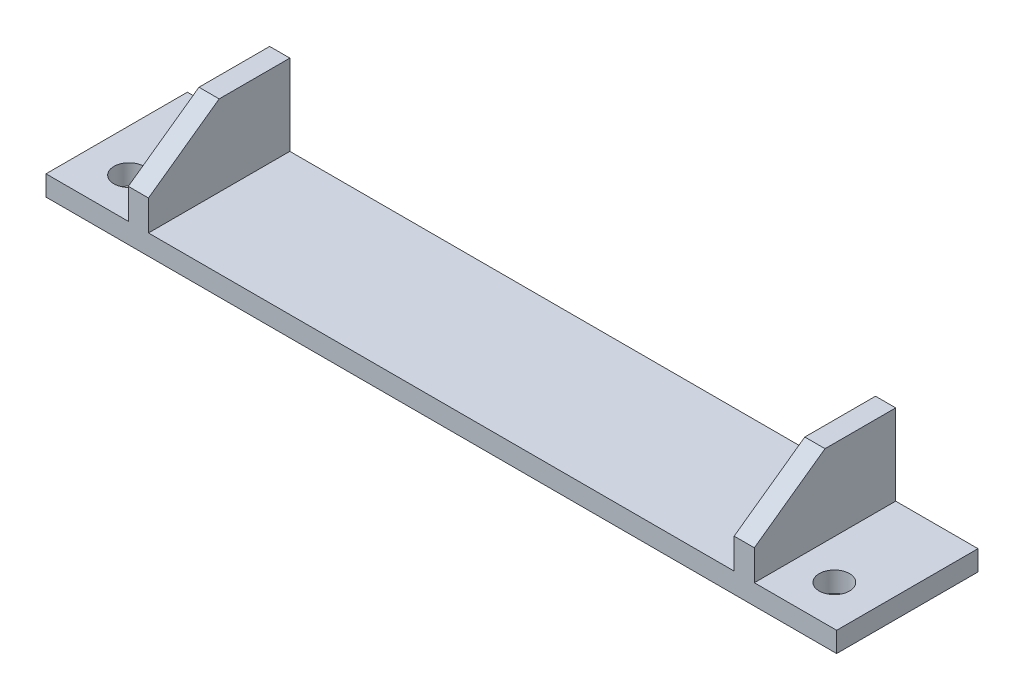
ISO-10303-21;
HEADER;
FILE_DESCRIPTION(('STEP AP214'),'2;1');
FILE_NAME('part.step','',(''),(''),'','','');
FILE_SCHEMA(('AUTOMOTIVE_DESIGN { 1 0 10303 214 1 1 1 1 }'));
ENDSEC;
DATA;
#1=APPLICATION_CONTEXT('core data for automotive mechanical design processes');
#2=APPLICATION_PROTOCOL_DEFINITION('international standard','automotive_design',2000,#1);
#3=PRODUCT_CONTEXT('',#1,'mechanical');
#4=PRODUCT('Part','Part','',(#3));
#5=PRODUCT_RELATED_PRODUCT_CATEGORY('part','',(#4));
#6=PRODUCT_DEFINITION_FORMATION('','',#4);
#7=PRODUCT_DEFINITION_CONTEXT('part definition',#1,'design');
#8=PRODUCT_DEFINITION('design','',#6,#7);
#9=PRODUCT_DEFINITION_SHAPE('','',#8);
#10=(LENGTH_UNIT() NAMED_UNIT(*) SI_UNIT(.MILLI.,.METRE.));
#11=(NAMED_UNIT(*) PLANE_ANGLE_UNIT() SI_UNIT($,.RADIAN.));
#12=(NAMED_UNIT(*) SI_UNIT($,.STERADIAN.) SOLID_ANGLE_UNIT());
#13=UNCERTAINTY_MEASURE_WITH_UNIT(LENGTH_MEASURE(1.E-05),#10,'distance_accuracy_value','');
#14=(GEOMETRIC_REPRESENTATION_CONTEXT(3) GLOBAL_UNCERTAINTY_ASSIGNED_CONTEXT((#13)) GLOBAL_UNIT_ASSIGNED_CONTEXT((#10,
#11,#12)) REPRESENTATION_CONTEXT('',''));
#15=CARTESIAN_POINT('',(0.,0.,0.));
#16=DIRECTION('',(0.,0.,1.));
#17=DIRECTION('',(1.,0.,0.));
#18=AXIS2_PLACEMENT_3D('',#15,#16,#17);
#19=CARTESIAN_POINT('',(0.,2.,0.));
#20=DIRECTION('',(0.,-1.,0.));
#21=DIRECTION('',(0.,0.,-1.));
#22=AXIS2_PLACEMENT_3D('',#19,#20,#21);
#23=PLANE('',#22);
#24=CARTESIAN_POINT('',(44.6246451696033,2.,-0.832823468273441));
#25=DIRECTION('',(0.,-1.,0.));
#26=DIRECTION('',(0.,0.,-1.));
#27=AXIS2_PLACEMENT_3D('',#24,#25,#26);
#28=CIRCLE('',#27,1.5);
#29=CARTESIAN_POINT('',(44.6246451696033,2.,-2.33282346827344));
#30=VERTEX_POINT('',#29);
#31=EDGE_CURVE('E292',#30,#30,#28,.T.);
#32=ORIENTED_EDGE('',*,*,#31,.T.);
#33=EDGE_LOOP('',(#32));
#34=FACE_BOUND('',#33,.T.);
#35=DIRECTION('',(0.,0.,-1.));
#36=VECTOR('',#35,1.);
#37=CARTESIAN_POINT('',(40.6996451696033,2.,-10.8328234682735));
#38=LINE('',#37,#36);
#39=CARTESIAN_POINT('',(40.6996451696033,2.,3.16717653172655));
#40=VERTEX_POINT('',#39);
#41=CARTESIAN_POINT('',(40.6996451696033,2.,-10.8328234682735));
#42=VERTEX_POINT('',#41);
#43=EDGE_CURVE('E223',#40,#42,#38,.T.);
#44=ORIENTED_EDGE('',*,*,#43,.F.);
#45=DIRECTION('',(1.,0.,0.));
#46=VECTOR('',#45,1.);
#47=CARTESIAN_POINT('',(-29.4503548303967,2.,3.16717653172655));
#48=LINE('',#47,#46);
#49=CARTESIAN_POINT('',(48.8496451696033,2.,3.16717653172654));
#50=VERTEX_POINT('',#49);
#51=EDGE_CURVE('E306',#40,#50,#48,.T.);
#52=ORIENTED_EDGE('',*,*,#51,.T.);
#53=DIRECTION('',(0.,0.,1.));
#54=VECTOR('',#53,1.);
#55=CARTESIAN_POINT('',(48.8496451696033,2.,-10.8328234682735));
#56=LINE('',#55,#54);
#57=CARTESIAN_POINT('',(48.8496451696033,2.,-10.8328234682735));
#58=VERTEX_POINT('',#57);
#59=EDGE_CURVE('E304',#58,#50,#56,.T.);
#60=ORIENTED_EDGE('',*,*,#59,.F.);
#61=DIRECTION('',(1.,0.,0.));
#62=VECTOR('',#61,1.);
#63=CARTESIAN_POINT('',(-29.4503548303967,2.,-10.8328234682734));
#64=LINE('',#63,#62);
#65=EDGE_CURVE('E309',#42,#58,#64,.T.);
#66=ORIENTED_EDGE('',*,*,#65,.F.);
#67=EDGE_LOOP('',(#44,#52,#60,#66));
#68=FACE_BOUND('',#67,.T.);
#69=ADVANCED_FACE('F42',(#34,#68),#23,.F.);
#70=DIRECTION('',(0.,0.,1.));
#71=VECTOR('',#70,1.);
#72=CARTESIAN_POINT('',(38.6996451696033,2.,-10.8328234682735));
#73=LINE('',#72,#71);
#74=CARTESIAN_POINT('',(38.6996451696033,2.,-10.8328234682735));
#75=VERTEX_POINT('',#74);
#76=CARTESIAN_POINT('',(38.6996451696033,2.,3.16717653172655));
#77=VERTEX_POINT('',#76);
#78=EDGE_CURVE('E368',#75,#77,#73,.T.);
#79=ORIENTED_EDGE('',*,*,#78,.F.);
#80=CARTESIAN_POINT('',(-19.3003548303967,2.,-10.8328234682734));
#81=VERTEX_POINT('',#80);
#82=EDGE_CURVE('E314',#81,#75,#64,.T.);
#83=ORIENTED_EDGE('',*,*,#82,.F.);
#84=DIRECTION('',(0.,0.,-1.));
#85=VECTOR('',#84,1.);
#86=CARTESIAN_POINT('',(-19.3003548303967,2.,-10.8328234682734));
#87=LINE('',#86,#85);
#88=CARTESIAN_POINT('',(-19.3003548303967,2.,3.16717653172655));
#89=VERTEX_POINT('',#88);
#90=EDGE_CURVE('E211',#89,#81,#87,.T.);
#91=ORIENTED_EDGE('',*,*,#90,.F.);
#92=EDGE_CURVE('E305',#89,#77,#48,.T.);
#93=ORIENTED_EDGE('',*,*,#92,.T.);
#94=EDGE_LOOP('',(#79,#83,#91,#93));
#95=FACE_BOUND('',#94,.T.);
#96=ADVANCED_FACE('F366',(#95),#23,.F.);
#97=CARTESIAN_POINT('',(-25.2253548303967,2.,-0.832823468273441));
#98=DIRECTION('',(0.,-1.,0.));
#99=DIRECTION('',(0.,0.,-1.));
#100=AXIS2_PLACEMENT_3D('',#97,#98,#99);
#101=CIRCLE('',#100,1.5);
#102=CARTESIAN_POINT('',(-25.2253548303967,2.,-2.33282346827344));
#103=VERTEX_POINT('',#102);
#104=EDGE_CURVE('E297',#103,#103,#101,.T.);
#105=ORIENTED_EDGE('',*,*,#104,.T.);
#106=EDGE_LOOP('',(#105));
#107=FACE_BOUND('',#106,.T.);
#108=DIRECTION('',(0.,0.,1.));
#109=VECTOR('',#108,1.);
#110=CARTESIAN_POINT('',(-21.3003548303967,2.,-10.8328234682734));
#111=LINE('',#110,#109);
#112=CARTESIAN_POINT('',(-21.3003548303967,2.,-10.8328234682734));
#113=VERTEX_POINT('',#112);
#114=CARTESIAN_POINT('',(-21.3003548303967,2.,3.16717653172655));
#115=VERTEX_POINT('',#114);
#116=EDGE_CURVE('E215',#113,#115,#111,.T.);
#117=ORIENTED_EDGE('',*,*,#116,.F.);
#118=CARTESIAN_POINT('',(-29.4503548303967,2.,-10.8328234682734));
#119=VERTEX_POINT('',#118);
#120=EDGE_CURVE('E310',#119,#113,#64,.T.);
#121=ORIENTED_EDGE('',*,*,#120,.F.);
#122=DIRECTION('',(0.,0.,1.));
#123=VECTOR('',#122,1.);
#124=CARTESIAN_POINT('',(-29.4503548303967,2.,-10.8328234682734));
#125=LINE('',#124,#123);
#126=CARTESIAN_POINT('',(-29.4503548303967,2.,3.16717653172655));
#127=VERTEX_POINT('',#126);
#128=EDGE_CURVE('E313',#119,#127,#125,.T.);
#129=ORIENTED_EDGE('',*,*,#128,.T.);
#130=EDGE_CURVE('E301',#127,#115,#48,.T.);
#131=ORIENTED_EDGE('',*,*,#130,.T.);
#132=EDGE_LOOP('',(#117,#121,#129,#131));
#133=FACE_BOUND('',#132,.T.);
#134=ADVANCED_FACE('F418',(#107,#133),#23,.F.);
#135=CARTESIAN_POINT('',(0.,0.,0.));
#136=DIRECTION('',(0.,-1.,0.));
#137=DIRECTION('',(0.,0.,-1.));
#138=AXIS2_PLACEMENT_3D('',#135,#136,#137);
#139=PLANE('',#138);
#140=CARTESIAN_POINT('',(-25.2253548303967,0.,-0.832823468273441));
#141=DIRECTION('',(0.,1.,0.));
#142=DIRECTION('',(0.,0.,1.));
#143=AXIS2_PLACEMENT_3D('',#140,#141,#142);
#144=CIRCLE('',#143,1.5);
#145=CARTESIAN_POINT('',(-25.2253548303967,0.,0.66717653172656));
#146=VERTEX_POINT('',#145);
#147=EDGE_CURVE('E289',#146,#146,#144,.T.);
#148=ORIENTED_EDGE('',*,*,#147,.T.);
#149=EDGE_LOOP('',(#148));
#150=FACE_BOUND('',#149,.T.);
#151=CARTESIAN_POINT('',(44.6246451696033,0.,-0.832823468273441));
#152=DIRECTION('',(0.,1.,0.));
#153=DIRECTION('',(0.,0.,1.));
#154=AXIS2_PLACEMENT_3D('',#151,#152,#153);
#155=CIRCLE('',#154,1.5);
#156=CARTESIAN_POINT('',(44.6246451696033,0.,0.667176531726563));
#157=VERTEX_POINT('',#156);
#158=EDGE_CURVE('E288',#157,#157,#155,.T.);
#159=ORIENTED_EDGE('',*,*,#158,.T.);
#160=EDGE_LOOP('',(#159));
#161=FACE_BOUND('',#160,.T.);
#162=DIRECTION('',(1.,0.,0.));
#163=VECTOR('',#162,1.);
#164=CARTESIAN_POINT('',(-29.4503548303967,0.,-10.8328234682734));
#165=LINE('',#164,#163);
#166=CARTESIAN_POINT('',(-9.50035483039672,0.,-10.8328234682734));
#167=VERTEX_POINT('',#166);
#168=CARTESIAN_POINT('',(28.8996451696033,0.,-10.8328234682734));
#169=VERTEX_POINT('',#168);
#170=EDGE_CURVE('E326',#167,#169,#165,.T.);
#171=ORIENTED_EDGE('',*,*,#170,.T.);
#172=DIRECTION('',(0.,0.,-1.));
#173=VECTOR('',#172,1.);
#174=CARTESIAN_POINT('',(28.8996451696033,0.,-10.8328234682734));
#175=LINE('',#174,#173);
#176=CARTESIAN_POINT('',(28.8996451696033,0.,-7.83282346827344));
#177=VERTEX_POINT('',#176);
#178=EDGE_CURVE('E248',#177,#169,#175,.T.);
#179=ORIENTED_EDGE('',*,*,#178,.F.);
#180=DIRECTION('',(-1.,0.,0.));
#181=VECTOR('',#180,1.);
#182=CARTESIAN_POINT('',(28.8996451696033,0.,-7.83282346827344));
#183=LINE('',#182,#181);
#184=CARTESIAN_POINT('',(31.8996451696033,0.,-7.83282346827344));
#185=VERTEX_POINT('',#184);
#186=EDGE_CURVE('E242',#185,#177,#183,.T.);
#187=ORIENTED_EDGE('',*,*,#186,.F.);
#188=DIRECTION('',(0.,0.,1.));
#189=VECTOR('',#188,1.);
#190=CARTESIAN_POINT('',(31.8996451696033,0.,-10.8328234682734));
#191=LINE('',#190,#189);
#192=CARTESIAN_POINT('',(31.8996451696033,0.,-10.8328234682734));
#193=VERTEX_POINT('',#192);
#194=EDGE_CURVE('E244',#193,#185,#191,.T.);
#195=ORIENTED_EDGE('',*,*,#194,.F.);
#196=CARTESIAN_POINT('',(48.8496451696033,0.,-10.8328234682735));
#197=VERTEX_POINT('',#196);
#198=EDGE_CURVE('E322',#193,#197,#165,.T.);
#199=ORIENTED_EDGE('',*,*,#198,.T.);
#200=DIRECTION('',(0.,0.,1.));
#201=VECTOR('',#200,1.);
#202=CARTESIAN_POINT('',(48.8496451696033,0.,-10.8328234682735));
#203=LINE('',#202,#201);
#204=CARTESIAN_POINT('',(48.8496451696033,0.,3.16717653172654));
#205=VERTEX_POINT('',#204);
#206=EDGE_CURVE('E319',#197,#205,#203,.T.);
#207=ORIENTED_EDGE('',*,*,#206,.T.);
#208=DIRECTION('',(1.,0.,0.));
#209=VECTOR('',#208,1.);
#210=CARTESIAN_POINT('',(-29.4503548303967,0.,3.16717653172655));
#211=LINE('',#210,#209);
#212=CARTESIAN_POINT('',(-29.4503548303967,0.,3.16717653172655));
#213=VERTEX_POINT('',#212);
#214=EDGE_CURVE('E300',#213,#205,#211,.T.);
#215=ORIENTED_EDGE('',*,*,#214,.F.);
#216=DIRECTION('',(0.,0.,1.));
#217=VECTOR('',#216,1.);
#218=CARTESIAN_POINT('',(-29.4503548303967,0.,-10.8328234682734));
#219=LINE('',#218,#217);
#220=CARTESIAN_POINT('',(-29.4503548303967,0.,-10.8328234682734));
#221=VERTEX_POINT('',#220);
#222=EDGE_CURVE('E325',#221,#213,#219,.T.);
#223=ORIENTED_EDGE('',*,*,#222,.F.);
#224=CARTESIAN_POINT('',(-12.5003548303967,0.,-10.8328234682734));
#225=VERTEX_POINT('',#224);
#226=EDGE_CURVE('E323',#221,#225,#165,.T.);
#227=ORIENTED_EDGE('',*,*,#226,.T.);
#228=DIRECTION('',(0.,0.,-1.));
#229=VECTOR('',#228,1.);
#230=CARTESIAN_POINT('',(-12.5003548303967,0.,-10.8328234682734));
#231=LINE('',#230,#229);
#232=CARTESIAN_POINT('',(-12.5003548303967,0.,-7.83282346827344));
#233=VERTEX_POINT('',#232);
#234=EDGE_CURVE('E263',#233,#225,#231,.T.);
#235=ORIENTED_EDGE('',*,*,#234,.F.);
#236=DIRECTION('',(-1.,0.,0.));
#237=VECTOR('',#236,1.);
#238=CARTESIAN_POINT('',(-9.50035483039672,0.,-7.83282346827344));
#239=LINE('',#238,#237);
#240=CARTESIAN_POINT('',(-9.50035483039672,0.,-7.83282346827344));
#241=VERTEX_POINT('',#240);
#242=EDGE_CURVE('E272',#241,#233,#239,.T.);
#243=ORIENTED_EDGE('',*,*,#242,.F.);
#244=DIRECTION('',(0.,0.,1.));
#245=VECTOR('',#244,1.);
#246=CARTESIAN_POINT('',(-9.50035483039672,0.,-10.8328234682734));
#247=LINE('',#246,#245);
#248=EDGE_CURVE('E251',#167,#241,#247,.T.);
#249=ORIENTED_EDGE('',*,*,#248,.F.);
#250=EDGE_LOOP('',(#171,#179,#187,#195,#199,#207,#215,#223,#227,#235,#243,#249));
#251=FACE_BOUND('',#250,.T.);
#252=ADVANCED_FACE('F349',(#150,#161,#251),#139,.T.);
#253=CARTESIAN_POINT('',(-29.4503548303967,2.,3.16717653172655));
#254=DIRECTION('',(0.,0.,-1.));
#255=DIRECTION('',(-1.,0.,0.));
#256=AXIS2_PLACEMENT_3D('',#253,#254,#255);
#257=PLANE('',#256);
#258=DIRECTION('',(0.,-1.,0.));
#259=VECTOR('',#258,1.);
#260=CARTESIAN_POINT('',(40.6996451696033,10.,3.16717653172655));
#261=LINE('',#260,#259);
#262=CARTESIAN_POINT('',(40.6996451696033,5.,3.16717653172655));
#263=VERTEX_POINT('',#262);
#264=EDGE_CURVE('E401',#263,#40,#261,.T.);
#265=ORIENTED_EDGE('',*,*,#264,.F.);
#266=DIRECTION('',(-1.,0.,0.));
#267=VECTOR('',#266,1.);
#268=CARTESIAN_POINT('',(48.8496451696033,5.,3.16717653172655));
#269=LINE('',#268,#267);
#270=CARTESIAN_POINT('',(38.6996451696033,5.,3.16717653172655));
#271=VERTEX_POINT('',#270);
#272=EDGE_CURVE('E374',#263,#271,#269,.T.);
#273=ORIENTED_EDGE('',*,*,#272,.T.);
#274=DIRECTION('',(0.,-1.,0.));
#275=VECTOR('',#274,1.);
#276=CARTESIAN_POINT('',(38.6996451696033,10.,3.16717653172655));
#277=LINE('',#276,#275);
#278=EDGE_CURVE('E373',#271,#77,#277,.T.);
#279=ORIENTED_EDGE('',*,*,#278,.T.);
#280=ORIENTED_EDGE('',*,*,#92,.F.);
#281=DIRECTION('',(0.,-1.,0.));
#282=VECTOR('',#281,1.);
#283=CARTESIAN_POINT('',(-19.3003548303967,10.,3.16717653172655));
#284=LINE('',#283,#282);
#285=CARTESIAN_POINT('',(-19.3003548303967,5.,3.16717653172655));
#286=VERTEX_POINT('',#285);
#287=EDGE_CURVE('E229',#286,#89,#284,.T.);
#288=ORIENTED_EDGE('',*,*,#287,.F.);
#289=CARTESIAN_POINT('',(-21.3003548303967,5.,3.16717653172655));
#290=VERTEX_POINT('',#289);
#291=EDGE_CURVE('E195',#286,#290,#269,.T.);
#292=ORIENTED_EDGE('',*,*,#291,.T.);
#293=DIRECTION('',(0.,-1.,0.));
#294=VECTOR('',#293,1.);
#295=CARTESIAN_POINT('',(-21.3003548303967,10.,3.16717653172655));
#296=LINE('',#295,#294);
#297=EDGE_CURVE('E204',#290,#115,#296,.T.);
#298=ORIENTED_EDGE('',*,*,#297,.T.);
#299=ORIENTED_EDGE('',*,*,#130,.F.);
#300=DIRECTION('',(0.,-1.,0.));
#301=VECTOR('',#300,1.);
#302=CARTESIAN_POINT('',(-29.4503548303967,2.,3.16717653172655));
#303=LINE('',#302,#301);
#304=EDGE_CURVE('E316',#127,#213,#303,.T.);
#305=ORIENTED_EDGE('',*,*,#304,.T.);
#306=ORIENTED_EDGE('',*,*,#214,.T.);
#307=DIRECTION('',(0.,-1.,0.));
#308=VECTOR('',#307,1.);
#309=CARTESIAN_POINT('',(48.8496451696033,2.,3.16717653172654));
#310=LINE('',#309,#308);
#311=EDGE_CURVE('E50',#50,#205,#310,.T.);
#312=ORIENTED_EDGE('',*,*,#311,.F.);
#313=ORIENTED_EDGE('',*,*,#51,.F.);
#314=EDGE_LOOP('',(#265,#273,#279,#280,#288,#292,#298,#299,#305,#306,#312,#313));
#315=FACE_BOUND('',#314,.T.);
#316=ADVANCED_FACE('F44',(#315),#257,.F.);
#317=CARTESIAN_POINT('',(48.8496451696033,2.,-10.8328234682735));
#318=DIRECTION('',(1.,0.,0.));
#319=DIRECTION('',(0.,0.,-1.));
#320=AXIS2_PLACEMENT_3D('',#317,#318,#319);
#321=PLANE('',#320);
#322=ORIENTED_EDGE('',*,*,#206,.F.);
#323=DIRECTION('',(0.,-1.,0.));
#324=VECTOR('',#323,1.);
#325=CARTESIAN_POINT('',(48.8496451696033,2.,-10.8328234682735));
#326=LINE('',#325,#324);
#327=EDGE_CURVE('E332',#58,#197,#326,.T.);
#328=ORIENTED_EDGE('',*,*,#327,.F.);
#329=ORIENTED_EDGE('',*,*,#59,.T.);
#330=ORIENTED_EDGE('',*,*,#311,.T.);
#331=EDGE_LOOP('',(#322,#328,#329,#330));
#332=FACE_BOUND('',#331,.T.);
#333=ADVANCED_FACE('F337',(#332),#321,.T.);
#334=CARTESIAN_POINT('',(-29.4503548303967,2.,-10.8328234682734));
#335=DIRECTION('',(0.,0.,-1.));
#336=DIRECTION('',(-1.,0.,0.));
#337=AXIS2_PLACEMENT_3D('',#334,#335,#336);
#338=PLANE('',#337);
#339=ORIENTED_EDGE('',*,*,#226,.F.);
#340=DIRECTION('',(0.,-1.,0.));
#341=VECTOR('',#340,1.);
#342=CARTESIAN_POINT('',(-29.4503548303967,2.,-10.8328234682734));
#343=LINE('',#342,#341);
#344=EDGE_CURVE('E330',#119,#221,#343,.T.);
#345=ORIENTED_EDGE('',*,*,#344,.F.);
#346=ORIENTED_EDGE('',*,*,#120,.T.);
#347=DIRECTION('',(0.,-1.,0.));
#348=VECTOR('',#347,1.);
#349=CARTESIAN_POINT('',(-21.3003548303967,10.,-10.8328234682734));
#350=LINE('',#349,#348);
#351=CARTESIAN_POINT('',(-21.3003548303967,10.,-10.8328234682734));
#352=VERTEX_POINT('',#351);
#353=EDGE_CURVE('E222',#352,#113,#350,.T.);
#354=ORIENTED_EDGE('',*,*,#353,.F.);
#355=DIRECTION('',(-1.,0.,0.));
#356=VECTOR('',#355,1.);
#357=CARTESIAN_POINT('',(-19.3003548303967,10.,-10.8328234682734));
#358=LINE('',#357,#356);
#359=CARTESIAN_POINT('',(-19.3003548303967,10.,-10.8328234682734));
#360=VERTEX_POINT('',#359);
#361=EDGE_CURVE('E208',#360,#352,#358,.T.);
#362=ORIENTED_EDGE('',*,*,#361,.F.);
#363=DIRECTION('',(0.,-1.,0.));
#364=VECTOR('',#363,1.);
#365=CARTESIAN_POINT('',(-19.3003548303967,10.,-10.8328234682734));
#366=LINE('',#365,#364);
#367=EDGE_CURVE('E226',#360,#81,#366,.T.);
#368=ORIENTED_EDGE('',*,*,#367,.T.);
#369=ORIENTED_EDGE('',*,*,#82,.T.);
#370=DIRECTION('',(0.,-1.,0.));
#371=VECTOR('',#370,1.);
#372=CARTESIAN_POINT('',(38.6996451696033,10.,-10.8328234682735));
#373=LINE('',#372,#371);
#374=CARTESIAN_POINT('',(38.6996451696033,10.,-10.8328234682735));
#375=VERTEX_POINT('',#374);
#376=EDGE_CURVE('E378',#375,#75,#373,.T.);
#377=ORIENTED_EDGE('',*,*,#376,.F.);
#378=DIRECTION('',(-1.,0.,0.));
#379=VECTOR('',#378,1.);
#380=CARTESIAN_POINT('',(38.6996451696033,10.,-10.8328234682735));
#381=LINE('',#380,#379);
#382=CARTESIAN_POINT('',(40.6996451696033,10.,-10.8328234682735));
#383=VERTEX_POINT('',#382);
#384=EDGE_CURVE('E385',#383,#375,#381,.T.);
#385=ORIENTED_EDGE('',*,*,#384,.F.);
#386=DIRECTION('',(0.,-1.,0.));
#387=VECTOR('',#386,1.);
#388=CARTESIAN_POINT('',(40.6996451696033,10.,-10.8328234682735));
#389=LINE('',#388,#387);
#390=EDGE_CURVE('E394',#383,#42,#389,.T.);
#391=ORIENTED_EDGE('',*,*,#390,.T.);
#392=ORIENTED_EDGE('',*,*,#65,.T.);
#393=ORIENTED_EDGE('',*,*,#327,.T.);
#394=ORIENTED_EDGE('',*,*,#198,.F.);
#395=DIRECTION('',(0.,1.,0.));
#396=VECTOR('',#395,1.);
#397=CARTESIAN_POINT('',(31.8996451696033,-2.,-10.8328234682734));
#398=LINE('',#397,#396);
#399=CARTESIAN_POINT('',(31.8996451696033,-2.,-10.8328234682734));
#400=VERTEX_POINT('',#399);
#401=EDGE_CURVE('E234',#400,#193,#398,.T.);
#402=ORIENTED_EDGE('',*,*,#401,.F.);
#403=DIRECTION('',(1.,0.,0.));
#404=VECTOR('',#403,1.);
#405=CARTESIAN_POINT('',(28.8996451696033,-2.,-10.8328234682734));
#406=LINE('',#405,#404);
#407=CARTESIAN_POINT('',(28.8996451696033,-2.,-10.8328234682734));
#408=VERTEX_POINT('',#407);
#409=EDGE_CURVE('E255',#408,#400,#406,.T.);
#410=ORIENTED_EDGE('',*,*,#409,.F.);
#411=DIRECTION('',(0.,1.,0.));
#412=VECTOR('',#411,1.);
#413=CARTESIAN_POINT('',(28.8996451696033,-2.,-10.8328234682734));
#414=LINE('',#413,#412);
#415=EDGE_CURVE('E232',#408,#169,#414,.T.);
#416=ORIENTED_EDGE('',*,*,#415,.T.);
#417=ORIENTED_EDGE('',*,*,#170,.F.);
#418=DIRECTION('',(0.,1.,0.));
#419=VECTOR('',#418,1.);
#420=CARTESIAN_POINT('',(-9.50035483039672,-2.,-10.8328234682734));
#421=LINE('',#420,#419);
#422=CARTESIAN_POINT('',(-9.50035483039672,-2.,-10.8328234682734));
#423=VERTEX_POINT('',#422);
#424=EDGE_CURVE('E269',#423,#167,#421,.T.);
#425=ORIENTED_EDGE('',*,*,#424,.F.);
#426=DIRECTION('',(1.,0.,0.));
#427=VECTOR('',#426,1.);
#428=CARTESIAN_POINT('',(-9.50035483039672,-2.,-10.8328234682734));
#429=LINE('',#428,#427);
#430=CARTESIAN_POINT('',(-12.5003548303967,-2.,-10.8328234682734));
#431=VERTEX_POINT('',#430);
#432=EDGE_CURVE('E267',#431,#423,#429,.T.);
#433=ORIENTED_EDGE('',*,*,#432,.F.);
#434=DIRECTION('',(0.,1.,0.));
#435=VECTOR('',#434,1.);
#436=CARTESIAN_POINT('',(-12.5003548303967,-2.,-10.8328234682734));
#437=LINE('',#436,#435);
#438=EDGE_CURVE('E279',#431,#225,#437,.T.);
#439=ORIENTED_EDGE('',*,*,#438,.T.);
#440=EDGE_LOOP('',(#339,#345,#346,#354,#362,#368,#369,#377,#385,#391,#392,#393,#394,#402,#410,
#416,#417,#425,#433,#439));
#441=FACE_BOUND('',#440,.T.);
#442=ADVANCED_FACE('F356',(#441),#338,.T.);
#443=CARTESIAN_POINT('',(-29.4503548303967,2.,-10.8328234682734));
#444=DIRECTION('',(1.,0.,0.));
#445=DIRECTION('',(0.,0.,-1.));
#446=AXIS2_PLACEMENT_3D('',#443,#444,#445);
#447=PLANE('',#446);
#448=ORIENTED_EDGE('',*,*,#222,.T.);
#449=ORIENTED_EDGE('',*,*,#304,.F.);
#450=ORIENTED_EDGE('',*,*,#128,.F.);
#451=ORIENTED_EDGE('',*,*,#344,.T.);
#452=EDGE_LOOP('',(#448,#449,#450,#451));
#453=FACE_BOUND('',#452,.T.);
#454=ADVANCED_FACE('F435',(#453),#447,.F.);
#455=CARTESIAN_POINT('',(44.6246451696033,0.,-0.832823468273441));
#456=DIRECTION('',(0.,1.,0.));
#457=DIRECTION('',(0.,0.,1.));
#458=AXIS2_PLACEMENT_3D('',#455,#456,#457);
#459=CYLINDRICAL_SURFACE('',#458,1.5);
#460=ORIENTED_EDGE('',*,*,#158,.F.);
#461=EDGE_LOOP('',(#460));
#462=FACE_BOUND('',#461,.T.);
#463=ORIENTED_EDGE('',*,*,#31,.F.);
#464=EDGE_LOOP('',(#463));
#465=FACE_BOUND('',#464,.T.);
#466=ADVANCED_FACE('F480',(#462,#465),#459,.F.);
#467=CARTESIAN_POINT('',(-25.2253548303967,0.,-0.832823468273441));
#468=DIRECTION('',(0.,1.,0.));
#469=DIRECTION('',(0.,0.,1.));
#470=AXIS2_PLACEMENT_3D('',#467,#468,#469);
#471=CYLINDRICAL_SURFACE('',#470,1.5);
#472=ORIENTED_EDGE('',*,*,#147,.F.);
#473=EDGE_LOOP('',(#472));
#474=FACE_BOUND('',#473,.T.);
#475=ORIENTED_EDGE('',*,*,#104,.F.);
#476=EDGE_LOOP('',(#475));
#477=FACE_BOUND('',#476,.T.);
#478=ADVANCED_FACE('F477',(#474,#477),#471,.F.);
#479=CARTESIAN_POINT('',(-9.50035483039672,-2.,-10.8328234682734));
#480=DIRECTION('',(-1.,0.,0.));
#481=DIRECTION('',(0.,0.,1.));
#482=AXIS2_PLACEMENT_3D('',#479,#480,#481);
#483=PLANE('',#482);
#484=ORIENTED_EDGE('',*,*,#248,.T.);
#485=DIRECTION('',(0.,1.,0.));
#486=VECTOR('',#485,1.);
#487=CARTESIAN_POINT('',(-9.50035483039672,-2.,-7.83282346827344));
#488=LINE('',#487,#486);
#489=CARTESIAN_POINT('',(-9.50035483039672,-2.,-7.83282346827344));
#490=VERTEX_POINT('',#489);
#491=EDGE_CURVE('E285',#490,#241,#488,.T.);
#492=ORIENTED_EDGE('',*,*,#491,.F.);
#493=DIRECTION('',(0.,0.,1.));
#494=VECTOR('',#493,1.);
#495=CARTESIAN_POINT('',(-9.50035483039672,-2.,-10.8328234682734));
#496=LINE('',#495,#494);
#497=EDGE_CURVE('E259',#423,#490,#496,.T.);
#498=ORIENTED_EDGE('',*,*,#497,.F.);
#499=ORIENTED_EDGE('',*,*,#424,.T.);
#500=EDGE_LOOP('',(#484,#492,#498,#499));
#501=FACE_BOUND('',#500,.T.);
#502=ADVANCED_FACE('F473',(#501),#483,.F.);
#503=CARTESIAN_POINT('',(-9.50035483039672,-2.,-7.83282346827344));
#504=DIRECTION('',(0.,0.,-1.));
#505=DIRECTION('',(-1.,0.,0.));
#506=AXIS2_PLACEMENT_3D('',#503,#504,#505);
#507=PLANE('',#506);
#508=ORIENTED_EDGE('',*,*,#242,.T.);
#509=DIRECTION('',(0.,1.,0.));
#510=VECTOR('',#509,1.);
#511=CARTESIAN_POINT('',(-12.5003548303967,-2.,-7.83282346827344));
#512=LINE('',#511,#510);
#513=CARTESIAN_POINT('',(-12.5003548303967,-2.,-7.83282346827344));
#514=VERTEX_POINT('',#513);
#515=EDGE_CURVE('E282',#514,#233,#512,.T.);
#516=ORIENTED_EDGE('',*,*,#515,.F.);
#517=DIRECTION('',(-1.,0.,0.));
#518=VECTOR('',#517,1.);
#519=CARTESIAN_POINT('',(-9.50035483039672,-2.,-7.83282346827344));
#520=LINE('',#519,#518);
#521=EDGE_CURVE('E262',#490,#514,#520,.T.);
#522=ORIENTED_EDGE('',*,*,#521,.F.);
#523=ORIENTED_EDGE('',*,*,#491,.T.);
#524=EDGE_LOOP('',(#508,#516,#522,#523));
#525=FACE_BOUND('',#524,.T.);
#526=ADVANCED_FACE('F469',(#525),#507,.F.);
#527=CARTESIAN_POINT('',(-12.5003548303967,-2.,-10.8328234682734));
#528=DIRECTION('',(1.,0.,0.));
#529=DIRECTION('',(0.,0.,-1.));
#530=AXIS2_PLACEMENT_3D('',#527,#528,#529);
#531=PLANE('',#530);
#532=ORIENTED_EDGE('',*,*,#234,.T.);
#533=ORIENTED_EDGE('',*,*,#438,.F.);
#534=DIRECTION('',(0.,0.,-1.));
#535=VECTOR('',#534,1.);
#536=CARTESIAN_POINT('',(-12.5003548303967,-2.,-10.8328234682734));
#537=LINE('',#536,#535);
#538=EDGE_CURVE('E265',#514,#431,#537,.T.);
#539=ORIENTED_EDGE('',*,*,#538,.F.);
#540=ORIENTED_EDGE('',*,*,#515,.T.);
#541=EDGE_LOOP('',(#532,#533,#539,#540));
#542=FACE_BOUND('',#541,.T.);
#543=ADVANCED_FACE('F465',(#542),#531,.F.);
#544=CARTESIAN_POINT('',(0.,-2.,0.));
#545=DIRECTION('',(0.,-1.,0.));
#546=DIRECTION('',(0.,0.,-1.));
#547=AXIS2_PLACEMENT_3D('',#544,#545,#546);
#548=PLANE('',#547);
#549=ORIENTED_EDGE('',*,*,#497,.T.);
#550=ORIENTED_EDGE('',*,*,#521,.T.);
#551=ORIENTED_EDGE('',*,*,#538,.T.);
#552=ORIENTED_EDGE('',*,*,#432,.T.);
#553=EDGE_LOOP('',(#549,#550,#551,#552));
#554=FACE_BOUND('',#553,.T.);
#555=ADVANCED_FACE('F451',(#554),#548,.T.);
#556=CARTESIAN_POINT('',(28.8996451696033,-2.,-10.8328234682734));
#557=DIRECTION('',(1.,0.,0.));
#558=DIRECTION('',(0.,0.,-1.));
#559=AXIS2_PLACEMENT_3D('',#556,#557,#558);
#560=PLANE('',#559);
#561=ORIENTED_EDGE('',*,*,#178,.T.);
#562=ORIENTED_EDGE('',*,*,#415,.F.);
#563=DIRECTION('',(0.,0.,-1.));
#564=VECTOR('',#563,1.);
#565=CARTESIAN_POINT('',(28.8996451696033,-2.,-10.8328234682734));
#566=LINE('',#565,#564);
#567=CARTESIAN_POINT('',(28.8996451696033,-2.,-7.83282346827344));
#568=VERTEX_POINT('',#567);
#569=EDGE_CURVE('E245',#568,#408,#566,.T.);
#570=ORIENTED_EDGE('',*,*,#569,.F.);
#571=DIRECTION('',(0.,1.,0.));
#572=VECTOR('',#571,1.);
#573=CARTESIAN_POINT('',(28.8996451696033,-2.,-7.83282346827344));
#574=LINE('',#573,#572);
#575=EDGE_CURVE('E238',#568,#177,#574,.T.);
#576=ORIENTED_EDGE('',*,*,#575,.T.);
#577=EDGE_LOOP('',(#561,#562,#570,#576));
#578=FACE_BOUND('',#577,.T.);
#579=ADVANCED_FACE('F447',(#578),#560,.F.);
#580=CARTESIAN_POINT('',(31.8996451696033,-2.,-10.8328234682734));
#581=DIRECTION('',(-1.,0.,0.));
#582=DIRECTION('',(0.,0.,1.));
#583=AXIS2_PLACEMENT_3D('',#580,#581,#582);
#584=PLANE('',#583);
#585=ORIENTED_EDGE('',*,*,#194,.T.);
#586=DIRECTION('',(0.,1.,0.));
#587=VECTOR('',#586,1.);
#588=CARTESIAN_POINT('',(31.8996451696033,-2.,-7.83282346827344));
#589=LINE('',#588,#587);
#590=CARTESIAN_POINT('',(31.8996451696033,-2.,-7.83282346827344));
#591=VERTEX_POINT('',#590);
#592=EDGE_CURVE('E236',#591,#185,#589,.T.);
#593=ORIENTED_EDGE('',*,*,#592,.F.);
#594=DIRECTION('',(0.,0.,1.));
#595=VECTOR('',#594,1.);
#596=CARTESIAN_POINT('',(31.8996451696033,-2.,-10.8328234682734));
#597=LINE('',#596,#595);
#598=EDGE_CURVE('E253',#400,#591,#597,.T.);
#599=ORIENTED_EDGE('',*,*,#598,.F.);
#600=ORIENTED_EDGE('',*,*,#401,.T.);
#601=EDGE_LOOP('',(#585,#593,#599,#600));
#602=FACE_BOUND('',#601,.T.);
#603=ADVANCED_FACE('F450',(#602),#584,.F.);
#604=CARTESIAN_POINT('',(28.8996451696033,-2.,-7.83282346827344));
#605=DIRECTION('',(0.,0.,-1.));
#606=DIRECTION('',(-1.,0.,0.));
#607=AXIS2_PLACEMENT_3D('',#604,#605,#606);
#608=PLANE('',#607);
#609=ORIENTED_EDGE('',*,*,#186,.T.);
#610=ORIENTED_EDGE('',*,*,#575,.F.);
#611=DIRECTION('',(-1.,0.,0.));
#612=VECTOR('',#611,1.);
#613=CARTESIAN_POINT('',(28.8996451696033,-2.,-7.83282346827344));
#614=LINE('',#613,#612);
#615=EDGE_CURVE('E241',#591,#568,#614,.T.);
#616=ORIENTED_EDGE('',*,*,#615,.F.);
#617=ORIENTED_EDGE('',*,*,#592,.T.);
#618=EDGE_LOOP('',(#609,#610,#616,#617));
#619=FACE_BOUND('',#618,.T.);
#620=ADVANCED_FACE('F455',(#619),#608,.F.);
#621=CARTESIAN_POINT('',(0.,-2.,0.));
#622=DIRECTION('',(0.,1.,0.));
#623=DIRECTION('',(0.,0.,1.));
#624=AXIS2_PLACEMENT_3D('',#621,#622,#623);
#625=PLANE('',#624);
#626=ORIENTED_EDGE('',*,*,#569,.T.);
#627=ORIENTED_EDGE('',*,*,#409,.T.);
#628=ORIENTED_EDGE('',*,*,#598,.T.);
#629=ORIENTED_EDGE('',*,*,#615,.T.);
#630=EDGE_LOOP('',(#626,#627,#628,#629));
#631=FACE_BOUND('',#630,.T.);
#632=ADVANCED_FACE('F443',(#631),#625,.F.);
#633=CARTESIAN_POINT('',(-21.3003548303967,10.,-10.8328234682734));
#634=DIRECTION('',(1.,0.,0.));
#635=DIRECTION('',(0.,0.,-1.));
#636=AXIS2_PLACEMENT_3D('',#633,#634,#635);
#637=PLANE('',#636);
#638=ORIENTED_EDGE('',*,*,#297,.F.);
#639=DIRECTION('',(0.,-0.581238193719096,0.813733471206735));
#640=VECTOR('',#639,1.);
#641=CARTESIAN_POINT('',(-21.3003548303967,5.,3.16717653172655));
#642=LINE('',#641,#640);
#643=CARTESIAN_POINT('',(-21.3003548303967,10.,-3.83282346827345));
#644=VERTEX_POINT('',#643);
#645=EDGE_CURVE('E190',#644,#290,#642,.T.);
#646=ORIENTED_EDGE('',*,*,#645,.F.);
#647=DIRECTION('',(0.,0.,1.));
#648=VECTOR('',#647,1.);
#649=CARTESIAN_POINT('',(-21.3003548303967,10.,-10.8328234682734));
#650=LINE('',#649,#648);
#651=EDGE_CURVE('E202',#352,#644,#650,.T.);
#652=ORIENTED_EDGE('',*,*,#651,.F.);
#653=ORIENTED_EDGE('',*,*,#353,.T.);
#654=ORIENTED_EDGE('',*,*,#116,.T.);
#655=EDGE_LOOP('',(#638,#646,#652,#653,#654));
#656=FACE_BOUND('',#655,.T.);
#657=ADVANCED_FACE('F200',(#656),#637,.F.);
#658=CARTESIAN_POINT('',(-19.3003548303967,10.,-10.8328234682734));
#659=DIRECTION('',(-1.,0.,0.));
#660=DIRECTION('',(0.,0.,1.));
#661=AXIS2_PLACEMENT_3D('',#658,#659,#660);
#662=PLANE('',#661);
#663=DIRECTION('',(0.,0.,-1.));
#664=VECTOR('',#663,1.);
#665=CARTESIAN_POINT('',(-19.3003548303967,10.,-10.8328234682734));
#666=LINE('',#665,#664);
#667=CARTESIAN_POINT('',(-19.3003548303967,10.,-3.83282346827345));
#668=VERTEX_POINT('',#667);
#669=EDGE_CURVE('E210',#668,#360,#666,.T.);
#670=ORIENTED_EDGE('',*,*,#669,.F.);
#671=DIRECTION('',(0.,-0.581238193719096,0.813733471206735));
#672=VECTOR('',#671,1.);
#673=CARTESIAN_POINT('',(-19.3003548303967,13.3108108108108,-8.46795860340858));
#674=LINE('',#673,#672);
#675=EDGE_CURVE('E57',#668,#286,#674,.T.);
#676=ORIENTED_EDGE('',*,*,#675,.T.);
#677=ORIENTED_EDGE('',*,*,#287,.T.);
#678=ORIENTED_EDGE('',*,*,#90,.T.);
#679=ORIENTED_EDGE('',*,*,#367,.F.);
#680=EDGE_LOOP('',(#670,#676,#677,#678,#679));
#681=FACE_BOUND('',#680,.T.);
#682=ADVANCED_FACE('F412',(#681),#662,.F.);
#683=CARTESIAN_POINT('',(0.,10.,0.));
#684=DIRECTION('',(0.,-1.,0.));
#685=DIRECTION('',(0.,0.,-1.));
#686=AXIS2_PLACEMENT_3D('',#683,#684,#685);
#687=PLANE('',#686);
#688=ORIENTED_EDGE('',*,*,#651,.T.);
#689=DIRECTION('',(-1.,0.,0.));
#690=VECTOR('',#689,1.);
#691=CARTESIAN_POINT('',(48.8496451696033,10.,-3.83282346827345));
#692=LINE('',#691,#690);
#693=EDGE_CURVE('E187',#668,#644,#692,.T.);
#694=ORIENTED_EDGE('',*,*,#693,.F.);
#695=ORIENTED_EDGE('',*,*,#669,.T.);
#696=ORIENTED_EDGE('',*,*,#361,.T.);
#697=EDGE_LOOP('',(#688,#694,#695,#696));
#698=FACE_BOUND('',#697,.T.);
#699=ADVANCED_FACE('F206',(#698),#687,.F.);
#700=CARTESIAN_POINT('',(40.6996451696033,10.,-10.8328234682735));
#701=DIRECTION('',(-1.,0.,0.));
#702=DIRECTION('',(0.,0.,1.));
#703=AXIS2_PLACEMENT_3D('',#700,#701,#702);
#704=PLANE('',#703);
#705=DIRECTION('',(0.,0.,-1.));
#706=VECTOR('',#705,1.);
#707=CARTESIAN_POINT('',(40.6996451696033,10.,-10.8328234682735));
#708=LINE('',#707,#706);
#709=CARTESIAN_POINT('',(40.6996451696033,10.,-3.83282346827345));
#710=VERTEX_POINT('',#709);
#711=EDGE_CURVE('E218',#710,#383,#708,.T.);
#712=ORIENTED_EDGE('',*,*,#711,.F.);
#713=DIRECTION('',(0.,-0.581238193719096,0.813733471206735));
#714=VECTOR('',#713,1.);
#715=CARTESIAN_POINT('',(40.6996451696033,13.3108108108108,-8.46795860340859));
#716=LINE('',#715,#714);
#717=EDGE_CURVE('E65',#710,#263,#716,.T.);
#718=ORIENTED_EDGE('',*,*,#717,.T.);
#719=ORIENTED_EDGE('',*,*,#264,.T.);
#720=ORIENTED_EDGE('',*,*,#43,.T.);
#721=ORIENTED_EDGE('',*,*,#390,.F.);
#722=EDGE_LOOP('',(#712,#718,#719,#720,#721));
#723=FACE_BOUND('',#722,.T.);
#724=ADVANCED_FACE('F404',(#723),#704,.F.);
#725=CARTESIAN_POINT('',(38.6996451696033,10.,-10.8328234682735));
#726=DIRECTION('',(1.,0.,0.));
#727=DIRECTION('',(0.,0.,-1.));
#728=AXIS2_PLACEMENT_3D('',#725,#726,#727);
#729=PLANE('',#728);
#730=ORIENTED_EDGE('',*,*,#278,.F.);
#731=DIRECTION('',(0.,0.581238193719096,-0.813733471206735));
#732=VECTOR('',#731,1.);
#733=CARTESIAN_POINT('',(38.6996451696033,13.3108108108108,-8.46795860340859));
#734=LINE('',#733,#732);
#735=CARTESIAN_POINT('',(38.6996451696033,10.,-3.83282346827345));
#736=VERTEX_POINT('',#735);
#737=EDGE_CURVE('E395',#271,#736,#734,.T.);
#738=ORIENTED_EDGE('',*,*,#737,.T.);
#739=DIRECTION('',(0.,0.,1.));
#740=VECTOR('',#739,1.);
#741=CARTESIAN_POINT('',(38.6996451696033,10.,-10.8328234682735));
#742=LINE('',#741,#740);
#743=EDGE_CURVE('E377',#375,#736,#742,.T.);
#744=ORIENTED_EDGE('',*,*,#743,.F.);
#745=ORIENTED_EDGE('',*,*,#376,.T.);
#746=ORIENTED_EDGE('',*,*,#78,.T.);
#747=EDGE_LOOP('',(#730,#738,#744,#745,#746));
#748=FACE_BOUND('',#747,.T.);
#749=ADVANCED_FACE('F380',(#748),#729,.F.);
#750=CARTESIAN_POINT('',(0.,10.,0.));
#751=DIRECTION('',(0.,-1.,0.));
#752=DIRECTION('',(0.,0.,-1.));
#753=AXIS2_PLACEMENT_3D('',#750,#751,#752);
#754=PLANE('',#753);
#755=ORIENTED_EDGE('',*,*,#743,.T.);
#756=DIRECTION('',(1.,0.,0.));
#757=VECTOR('',#756,1.);
#758=CARTESIAN_POINT('',(0.,10.,-3.83282346827345));
#759=LINE('',#758,#757);
#760=EDGE_CURVE('E11',#736,#710,#759,.T.);
#761=ORIENTED_EDGE('',*,*,#760,.T.);
#762=ORIENTED_EDGE('',*,*,#711,.T.);
#763=ORIENTED_EDGE('',*,*,#384,.T.);
#764=EDGE_LOOP('',(#755,#761,#762,#763));
#765=FACE_BOUND('',#764,.T.);
#766=ADVANCED_FACE('F391',(#765),#754,.F.);
#767=CARTESIAN_POINT('',(48.8496451696033,5.,3.16717653172655));
#768=DIRECTION('',(0.,-0.813733471206735,-0.581238193719096));
#769=DIRECTION('',(0.,0.581238193719096,-0.813733471206735));
#770=AXIS2_PLACEMENT_3D('',#767,#768,#769);
#771=PLANE('',#770);
#772=ORIENTED_EDGE('',*,*,#760,.F.);
#773=ORIENTED_EDGE('',*,*,#737,.F.);
#774=ORIENTED_EDGE('',*,*,#272,.F.);
#775=ORIENTED_EDGE('',*,*,#717,.F.);
#776=EDGE_LOOP('',(#772,#773,#774,#775));
#777=FACE_BOUND('',#776,.T.);
#778=ADVANCED_FACE('F637',(#777),#771,.F.);
#779=ORIENTED_EDGE('',*,*,#693,.T.);
#780=ORIENTED_EDGE('',*,*,#645,.T.);
#781=ORIENTED_EDGE('',*,*,#291,.F.);
#782=ORIENTED_EDGE('',*,*,#675,.F.);
#783=EDGE_LOOP('',(#779,#780,#781,#782));
#784=FACE_BOUND('',#783,.T.);
#785=ADVANCED_FACE('F189',(#784),#771,.F.);
#786=CLOSED_SHELL('',(#69,#96,#134,#252,#316,#333,#442,#454,#466,#478,#502,#526,#543,#555,#579,
#603,#620,#632,#657,#682,#699,#724,#749,#766,#778,#785));
#787=MANIFOLD_SOLID_BREP('B2',#786);
#788=ADVANCED_BREP_SHAPE_REPRESENTATION('',(#18,#787),#14);
#789=SHAPE_DEFINITION_REPRESENTATION(#9,#788);
ENDSEC;
END-ISO-10303-21;
